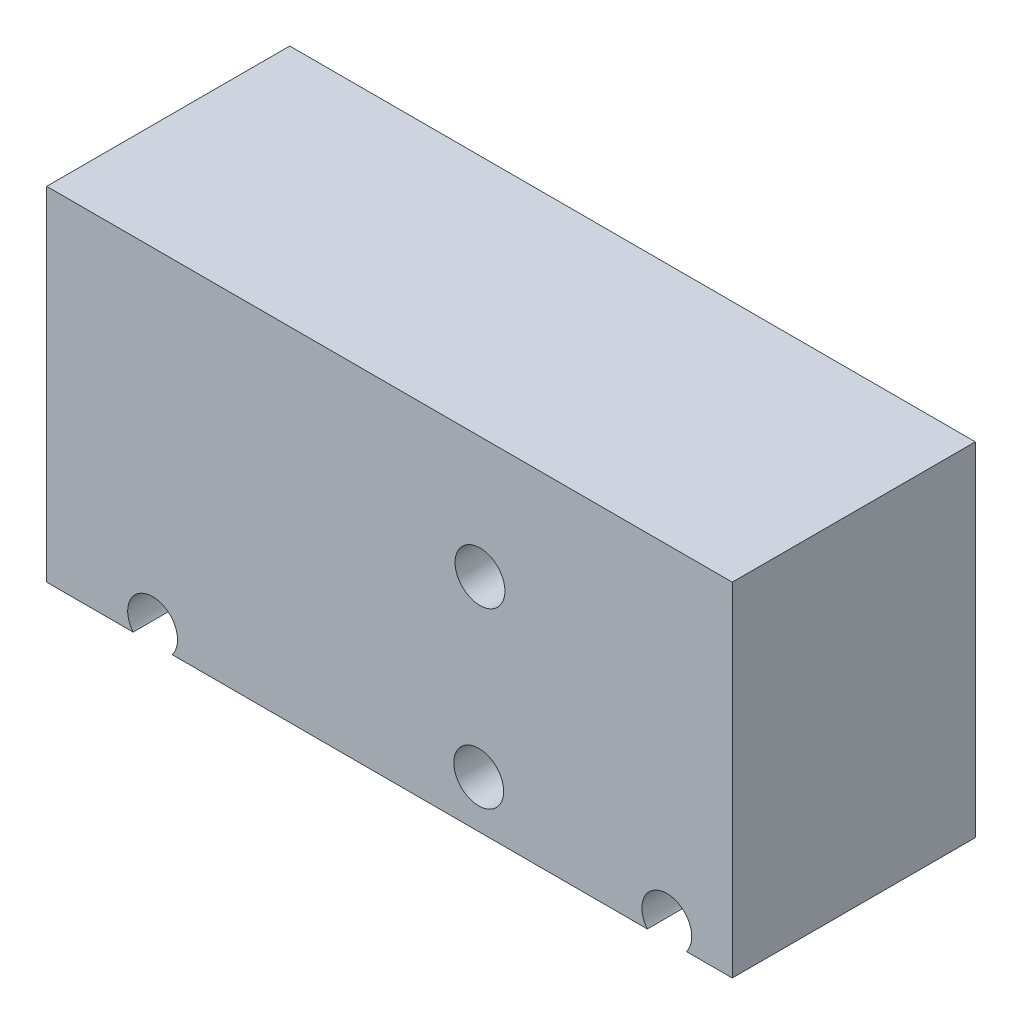
ISO-10303-21;
HEADER;
FILE_DESCRIPTION(('STEP AP214'),'2;1');
FILE_NAME('part.step','',(''),(''),'','','');
FILE_SCHEMA(('AUTOMOTIVE_DESIGN { 1 0 10303 214 1 1 1 1 }'));
ENDSEC;
DATA;
#1=APPLICATION_CONTEXT('core data for automotive mechanical design processes');
#2=APPLICATION_PROTOCOL_DEFINITION('international standard','automotive_design',2000,#1);
#3=PRODUCT_CONTEXT('',#1,'mechanical');
#4=PRODUCT('Part','Part','',(#3));
#5=PRODUCT_RELATED_PRODUCT_CATEGORY('part','',(#4));
#6=PRODUCT_DEFINITION_FORMATION('','',#4);
#7=PRODUCT_DEFINITION_CONTEXT('part definition',#1,'design');
#8=PRODUCT_DEFINITION('design','',#6,#7);
#9=PRODUCT_DEFINITION_SHAPE('','',#8);
#10=(LENGTH_UNIT() NAMED_UNIT(*) SI_UNIT(.MILLI.,.METRE.));
#11=(NAMED_UNIT(*) PLANE_ANGLE_UNIT() SI_UNIT($,.RADIAN.));
#12=(NAMED_UNIT(*) SI_UNIT($,.STERADIAN.) SOLID_ANGLE_UNIT());
#13=UNCERTAINTY_MEASURE_WITH_UNIT(LENGTH_MEASURE(1.E-05),#10,'distance_accuracy_value','');
#14=(GEOMETRIC_REPRESENTATION_CONTEXT(3) GLOBAL_UNCERTAINTY_ASSIGNED_CONTEXT((#13)) GLOBAL_UNIT_ASSIGNED_CONTEXT((#10,
#11,#12)) REPRESENTATION_CONTEXT('',''));
#15=CARTESIAN_POINT('',(0.,0.,0.));
#16=DIRECTION('',(0.,0.,1.));
#17=DIRECTION('',(1.,0.,0.));
#18=AXIS2_PLACEMENT_3D('',#15,#16,#17);
#19=CARTESIAN_POINT('',(14.524,8.01999999999999,39.));
#20=DIRECTION('',(0.,0.,-1.));
#21=DIRECTION('',(-1.,0.,0.));
#22=AXIS2_PLACEMENT_3D('',#19,#20,#21);
#23=CYLINDRICAL_SURFACE('',#22,4.);
#24=CARTESIAN_POINT('',(14.524,8.01999999999999,39.));
#25=DIRECTION('',(0.,0.,-1.));
#26=DIRECTION('',(-1.,0.,0.));
#27=AXIS2_PLACEMENT_3D('',#24,#25,#26);
#28=CIRCLE('',#27,4.);
#29=CARTESIAN_POINT('',(10.524,8.01999999999999,39.));
#30=VERTEX_POINT('',#29);
#31=EDGE_CURVE('E176',#30,#30,#28,.F.);
#32=ORIENTED_EDGE('',*,*,#31,.T.);
#33=EDGE_LOOP('',(#32));
#34=FACE_BOUND('',#33,.T.);
#35=CARTESIAN_POINT('',(14.524,8.01999999999999,3.));
#36=DIRECTION('',(0.,0.,-1.));
#37=DIRECTION('',(-1.,0.,0.));
#38=AXIS2_PLACEMENT_3D('',#35,#36,#37);
#39=CIRCLE('',#38,4.);
#40=CARTESIAN_POINT('',(10.524,8.01999999999999,3.));
#41=VERTEX_POINT('',#40);
#42=EDGE_CURVE('E20',#41,#41,#39,.T.);
#43=ORIENTED_EDGE('',*,*,#42,.T.);
#44=EDGE_LOOP('',(#43));
#45=FACE_BOUND('',#44,.T.);
#46=ADVANCED_FACE('F17',(#34,#45),#23,.F.);
#47=CARTESIAN_POINT('',(14.324,-19.92,39.));
#48=DIRECTION('',(0.,0.,-1.));
#49=DIRECTION('',(-1.,0.,0.));
#50=AXIS2_PLACEMENT_3D('',#47,#48,#49);
#51=CYLINDRICAL_SURFACE('',#50,4.);
#52=CARTESIAN_POINT('',(14.324,-19.92,39.));
#53=DIRECTION('',(0.,0.,-1.));
#54=DIRECTION('',(-1.,0.,0.));
#55=AXIS2_PLACEMENT_3D('',#52,#53,#54);
#56=CIRCLE('',#55,4.);
#57=CARTESIAN_POINT('',(10.324,-19.92,39.));
#58=VERTEX_POINT('',#57);
#59=EDGE_CURVE('E173',#58,#58,#56,.F.);
#60=ORIENTED_EDGE('',*,*,#59,.T.);
#61=EDGE_LOOP('',(#60));
#62=FACE_BOUND('',#61,.T.);
#63=CARTESIAN_POINT('',(14.324,-19.92,3.));
#64=DIRECTION('',(0.,0.,-1.));
#65=DIRECTION('',(-1.,0.,0.));
#66=AXIS2_PLACEMENT_3D('',#63,#64,#65);
#67=CIRCLE('',#66,4.);
#68=CARTESIAN_POINT('',(10.324,-19.92,3.));
#69=VERTEX_POINT('',#68);
#70=EDGE_CURVE('E90',#69,#69,#67,.T.);
#71=ORIENTED_EDGE('',*,*,#70,.T.);
#72=EDGE_LOOP('',(#71));
#73=FACE_BOUND('',#72,.T.);
#74=ADVANCED_FACE('F189',(#62,#73),#51,.F.);
#75=CARTESIAN_POINT('',(14.524,8.01999999999999,3.));
#76=DIRECTION('',(0.,0.,-1.));
#77=DIRECTION('',(-1.,0.,0.));
#78=AXIS2_PLACEMENT_3D('',#75,#76,#77);
#79=PLANE('',#78);
#80=CARTESIAN_POINT('',(14.524,8.01999999999999,3.));
#81=DIRECTION('',(0.,0.,-1.));
#82=DIRECTION('',(-1.,0.,0.));
#83=AXIS2_PLACEMENT_3D('',#80,#81,#82);
#84=CIRCLE('',#83,1.651);
#85=CARTESIAN_POINT('',(12.873,8.01999999999999,3.));
#86=VERTEX_POINT('',#85);
#87=EDGE_CURVE('E167',#86,#86,#84,.T.);
#88=ORIENTED_EDGE('',*,*,#87,.T.);
#89=EDGE_LOOP('',(#88));
#90=FACE_BOUND('',#89,.T.);
#91=ORIENTED_EDGE('',*,*,#42,.F.);
#92=EDGE_LOOP('',(#91));
#93=FACE_BOUND('',#92,.T.);
#94=ADVANCED_FACE('F186',(#90,#93),#79,.F.);
#95=CARTESIAN_POINT('',(14.324,-19.92,3.));
#96=DIRECTION('',(0.,0.,-1.));
#97=DIRECTION('',(-1.,0.,0.));
#98=AXIS2_PLACEMENT_3D('',#95,#96,#97);
#99=PLANE('',#98);
#100=CARTESIAN_POINT('',(14.324,-19.92,3.));
#101=DIRECTION('',(0.,0.,-1.));
#102=DIRECTION('',(-1.,0.,0.));
#103=AXIS2_PLACEMENT_3D('',#100,#101,#102);
#104=CIRCLE('',#103,1.651);
#105=CARTESIAN_POINT('',(12.673,-19.92,3.));
#106=VERTEX_POINT('',#105);
#107=EDGE_CURVE('E164',#106,#106,#104,.T.);
#108=ORIENTED_EDGE('',*,*,#107,.T.);
#109=EDGE_LOOP('',(#108));
#110=FACE_BOUND('',#109,.T.);
#111=ORIENTED_EDGE('',*,*,#70,.F.);
#112=EDGE_LOOP('',(#111));
#113=FACE_BOUND('',#112,.T.);
#114=ADVANCED_FACE('F188',(#110,#113),#99,.F.);
#115=CARTESIAN_POINT('',(-38.,-25.,3.));
#116=DIRECTION('',(0.,0.,-1.));
#117=DIRECTION('',(-1.,0.,0.));
#118=AXIS2_PLACEMENT_3D('',#115,#116,#117);
#119=PLANE('',#118);
#120=DIRECTION('',(1.,0.,0.));
#121=VECTOR('',#120,1.);
#122=CARTESIAN_POINT('',(-55.,-27.5,3.));
#123=LINE('',#122,#121);
#124=CARTESIAN_POINT('',(-41.1224989991992,-27.5,3.));
#125=VERTEX_POINT('',#124);
#126=CARTESIAN_POINT('',(-34.8775010008008,-27.5,3.));
#127=VERTEX_POINT('',#126);
#128=EDGE_CURVE('E80',#125,#127,#123,.T.);
#129=ORIENTED_EDGE('',*,*,#128,.T.);
#130=CARTESIAN_POINT('',(-38.,-25.,3.));
#131=DIRECTION('',(0.,0.,-1.));
#132=DIRECTION('',(-1.,0.,0.));
#133=AXIS2_PLACEMENT_3D('',#130,#131,#132);
#134=CIRCLE('',#133,4.);
#135=EDGE_CURVE('E82',#127,#125,#134,.F.);
#136=ORIENTED_EDGE('',*,*,#135,.T.);
#137=EDGE_LOOP('',(#129,#136));
#138=FACE_BOUND('',#137,.T.);
#139=CARTESIAN_POINT('',(-38.,-25.,3.));
#140=DIRECTION('',(0.,0.,-1.));
#141=DIRECTION('',(-1.,0.,0.));
#142=AXIS2_PLACEMENT_3D('',#139,#140,#141);
#143=CIRCLE('',#142,1.651);
#144=CARTESIAN_POINT('',(-39.651,-25.,3.));
#145=VERTEX_POINT('',#144);
#146=EDGE_CURVE('E126',#145,#145,#143,.T.);
#147=ORIENTED_EDGE('',*,*,#146,.T.);
#148=EDGE_LOOP('',(#147));
#149=FACE_BOUND('',#148,.T.);
#150=ADVANCED_FACE('F84',(#138,#149),#119,.F.);
#151=CARTESIAN_POINT('',(-38.,-25.,39.));
#152=DIRECTION('',(0.,0.,-1.));
#153=DIRECTION('',(-1.,0.,0.));
#154=AXIS2_PLACEMENT_3D('',#151,#152,#153);
#155=CYLINDRICAL_SURFACE('',#154,4.);
#156=DIRECTION('',(0.,0.,1.));
#157=VECTOR('',#156,1.);
#158=CARTESIAN_POINT('',(-34.8775010008008,-27.5,39.));
#159=LINE('',#158,#157);
#160=CARTESIAN_POINT('',(-34.8775010008008,-27.5,39.));
#161=VERTEX_POINT('',#160);
#162=EDGE_CURVE('E104',#127,#161,#159,.T.);
#163=ORIENTED_EDGE('',*,*,#162,.T.);
#164=CARTESIAN_POINT('',(-38.,-25.,39.));
#165=DIRECTION('',(0.,0.,-1.));
#166=DIRECTION('',(-1.,0.,0.));
#167=AXIS2_PLACEMENT_3D('',#164,#165,#166);
#168=CIRCLE('',#167,4.);
#169=CARTESIAN_POINT('',(-41.1224989991992,-27.5,39.));
#170=VERTEX_POINT('',#169);
#171=EDGE_CURVE('E95',#161,#170,#168,.F.);
#172=ORIENTED_EDGE('',*,*,#171,.T.);
#173=DIRECTION('',(0.,0.,1.));
#174=VECTOR('',#173,1.);
#175=CARTESIAN_POINT('',(-41.1224989991992,-27.5,39.));
#176=LINE('',#175,#174);
#177=EDGE_CURVE('E93',#170,#125,#176,.F.);
#178=ORIENTED_EDGE('',*,*,#177,.T.);
#179=ORIENTED_EDGE('',*,*,#135,.F.);
#180=EDGE_LOOP('',(#163,#172,#178,#179));
#181=FACE_BOUND('',#180,.T.);
#182=ADVANCED_FACE('F94',(#181),#155,.F.);
#183=CARTESIAN_POINT('',(44.5,-25.,3.));
#184=DIRECTION('',(0.,0.,-1.));
#185=DIRECTION('',(-1.,0.,0.));
#186=AXIS2_PLACEMENT_3D('',#183,#184,#185);
#187=PLANE('',#186);
#188=DIRECTION('',(1.,0.,0.));
#189=VECTOR('',#188,1.);
#190=CARTESIAN_POINT('',(-55.,-27.5,3.));
#191=LINE('',#190,#189);
#192=CARTESIAN_POINT('',(41.3775010008008,-27.5,3.));
#193=VERTEX_POINT('',#192);
#194=CARTESIAN_POINT('',(47.6224989991993,-27.5,3.));
#195=VERTEX_POINT('',#194);
#196=EDGE_CURVE('E370',#193,#195,#191,.T.);
#197=ORIENTED_EDGE('',*,*,#196,.T.);
#198=CARTESIAN_POINT('',(44.5,-25.,3.));
#199=DIRECTION('',(0.,0.,-1.));
#200=DIRECTION('',(-1.,0.,0.));
#201=AXIS2_PLACEMENT_3D('',#198,#199,#200);
#202=CIRCLE('',#201,4.);
#203=EDGE_CURVE('E89',#195,#193,#202,.F.);
#204=ORIENTED_EDGE('',*,*,#203,.T.);
#205=EDGE_LOOP('',(#197,#204));
#206=FACE_BOUND('',#205,.T.);
#207=CARTESIAN_POINT('',(44.5,-25.,3.));
#208=DIRECTION('',(0.,0.,-1.));
#209=DIRECTION('',(-1.,0.,0.));
#210=AXIS2_PLACEMENT_3D('',#207,#208,#209);
#211=CIRCLE('',#210,1.651);
#212=CARTESIAN_POINT('',(42.849,-25.,3.));
#213=VERTEX_POINT('',#212);
#214=EDGE_CURVE('E161',#213,#213,#211,.T.);
#215=ORIENTED_EDGE('',*,*,#214,.T.);
#216=EDGE_LOOP('',(#215));
#217=FACE_BOUND('',#216,.T.);
#218=ADVANCED_FACE('F245',(#206,#217),#187,.F.);
#219=CARTESIAN_POINT('',(44.5,-25.,39.));
#220=DIRECTION('',(0.,0.,-1.));
#221=DIRECTION('',(-1.,0.,0.));
#222=AXIS2_PLACEMENT_3D('',#219,#220,#221);
#223=CYLINDRICAL_SURFACE('',#222,4.);
#224=DIRECTION('',(0.,0.,1.));
#225=VECTOR('',#224,1.);
#226=CARTESIAN_POINT('',(47.6224989991993,-27.5,39.));
#227=LINE('',#226,#225);
#228=CARTESIAN_POINT('',(47.6224989991993,-27.5,39.));
#229=VERTEX_POINT('',#228);
#230=EDGE_CURVE('E376',#195,#229,#227,.T.);
#231=ORIENTED_EDGE('',*,*,#230,.T.);
#232=CARTESIAN_POINT('',(44.5,-25.,39.));
#233=DIRECTION('',(0.,0.,-1.));
#234=DIRECTION('',(-1.,0.,0.));
#235=AXIS2_PLACEMENT_3D('',#232,#233,#234);
#236=CIRCLE('',#235,4.);
#237=CARTESIAN_POINT('',(41.3775010008008,-27.5,39.));
#238=VERTEX_POINT('',#237);
#239=EDGE_CURVE('E170',#229,#238,#236,.F.);
#240=ORIENTED_EDGE('',*,*,#239,.T.);
#241=DIRECTION('',(0.,0.,1.));
#242=VECTOR('',#241,1.);
#243=CARTESIAN_POINT('',(41.3775010008008,-27.5,39.));
#244=LINE('',#243,#242);
#245=EDGE_CURVE('E377',#238,#193,#244,.F.);
#246=ORIENTED_EDGE('',*,*,#245,.T.);
#247=ORIENTED_EDGE('',*,*,#203,.F.);
#248=EDGE_LOOP('',(#231,#240,#246,#247));
#249=FACE_BOUND('',#248,.T.);
#250=ADVANCED_FACE('F241',(#249),#223,.F.);
#251=CARTESIAN_POINT('',(0.,0.,39.));
#252=DIRECTION('',(0.,0.,-1.));
#253=DIRECTION('',(-1.,0.,0.));
#254=AXIS2_PLACEMENT_3D('',#251,#252,#253);
#255=PLANE('',#254);
#256=ORIENTED_EDGE('',*,*,#239,.F.);
#257=DIRECTION('',(1.,0.,0.));
#258=VECTOR('',#257,1.);
#259=CARTESIAN_POINT('',(-55.,-27.5,39.));
#260=LINE('',#259,#258);
#261=CARTESIAN_POINT('',(55.,-27.5,39.));
#262=VERTEX_POINT('',#261);
#263=EDGE_CURVE('E117',#229,#262,#260,.T.);
#264=ORIENTED_EDGE('',*,*,#263,.T.);
#265=DIRECTION('',(0.,1.,0.));
#266=VECTOR('',#265,1.);
#267=CARTESIAN_POINT('',(55.,-27.5,39.));
#268=LINE('',#267,#266);
#269=CARTESIAN_POINT('',(55.,27.5,39.));
#270=VERTEX_POINT('',#269);
#271=EDGE_CURVE('E124',#262,#270,#268,.T.);
#272=ORIENTED_EDGE('',*,*,#271,.T.);
#273=DIRECTION('',(1.,0.,0.));
#274=VECTOR('',#273,1.);
#275=CARTESIAN_POINT('',(-55.,27.5,39.));
#276=LINE('',#275,#274);
#277=CARTESIAN_POINT('',(-55.,27.5,39.));
#278=VERTEX_POINT('',#277);
#279=EDGE_CURVE('E142',#270,#278,#276,.F.);
#280=ORIENTED_EDGE('',*,*,#279,.T.);
#281=DIRECTION('',(0.,1.,0.));
#282=VECTOR('',#281,1.);
#283=CARTESIAN_POINT('',(-55.,-27.5,39.));
#284=LINE('',#283,#282);
#285=CARTESIAN_POINT('',(-55.,-27.5,39.));
#286=VERTEX_POINT('',#285);
#287=EDGE_CURVE('E114',#278,#286,#284,.F.);
#288=ORIENTED_EDGE('',*,*,#287,.T.);
#289=DIRECTION('',(1.,0.,0.));
#290=VECTOR('',#289,1.);
#291=CARTESIAN_POINT('',(-55.,-27.5,39.));
#292=LINE('',#291,#290);
#293=EDGE_CURVE('E99',#286,#170,#292,.T.);
#294=ORIENTED_EDGE('',*,*,#293,.T.);
#295=ORIENTED_EDGE('',*,*,#171,.F.);
#296=DIRECTION('',(1.,0.,0.));
#297=VECTOR('',#296,1.);
#298=CARTESIAN_POINT('',(-55.,-27.5,39.));
#299=LINE('',#298,#297);
#300=EDGE_CURVE('E106',#161,#238,#299,.T.);
#301=ORIENTED_EDGE('',*,*,#300,.T.);
#302=EDGE_LOOP('',(#256,#264,#272,#280,#288,#294,#295,#301));
#303=FACE_BOUND('',#302,.T.);
#304=ORIENTED_EDGE('',*,*,#59,.F.);
#305=EDGE_LOOP('',(#304));
#306=FACE_BOUND('',#305,.T.);
#307=ORIENTED_EDGE('',*,*,#31,.F.);
#308=EDGE_LOOP('',(#307));
#309=FACE_BOUND('',#308,.T.);
#310=ADVANCED_FACE('F237',(#303,#306,#309),#255,.F.);
#311=CARTESIAN_POINT('',(14.524,8.01999999999999,39.));
#312=DIRECTION('',(0.,0.,-1.));
#313=DIRECTION('',(-1.,0.,0.));
#314=AXIS2_PLACEMENT_3D('',#311,#312,#313);
#315=CYLINDRICAL_SURFACE('',#314,1.651);
#316=CARTESIAN_POINT('',(14.524,8.01999999999999,0.));
#317=DIRECTION('',(0.,0.,-1.));
#318=DIRECTION('',(-1.,0.,0.));
#319=AXIS2_PLACEMENT_3D('',#316,#317,#318);
#320=CIRCLE('',#319,1.651);
#321=CARTESIAN_POINT('',(12.873,8.01999999999999,0.));
#322=VERTEX_POINT('',#321);
#323=EDGE_CURVE('E156',#322,#322,#320,.F.);
#324=ORIENTED_EDGE('',*,*,#323,.F.);
#325=EDGE_LOOP('',(#324));
#326=FACE_BOUND('',#325,.T.);
#327=ORIENTED_EDGE('',*,*,#87,.F.);
#328=EDGE_LOOP('',(#327));
#329=FACE_BOUND('',#328,.T.);
#330=ADVANCED_FACE('F233',(#326,#329),#315,.F.);
#331=CARTESIAN_POINT('',(14.324,-19.92,39.));
#332=DIRECTION('',(0.,0.,-1.));
#333=DIRECTION('',(-1.,0.,0.));
#334=AXIS2_PLACEMENT_3D('',#331,#332,#333);
#335=CYLINDRICAL_SURFACE('',#334,1.651);
#336=CARTESIAN_POINT('',(14.324,-19.92,0.));
#337=DIRECTION('',(0.,0.,-1.));
#338=DIRECTION('',(-1.,0.,0.));
#339=AXIS2_PLACEMENT_3D('',#336,#337,#338);
#340=CIRCLE('',#339,1.651);
#341=CARTESIAN_POINT('',(12.673,-19.92,0.));
#342=VERTEX_POINT('',#341);
#343=EDGE_CURVE('E153',#342,#342,#340,.F.);
#344=ORIENTED_EDGE('',*,*,#343,.F.);
#345=EDGE_LOOP('',(#344));
#346=FACE_BOUND('',#345,.T.);
#347=ORIENTED_EDGE('',*,*,#107,.F.);
#348=EDGE_LOOP('',(#347));
#349=FACE_BOUND('',#348,.T.);
#350=ADVANCED_FACE('F229',(#346,#349),#335,.F.);
#351=CARTESIAN_POINT('',(44.5,-25.,39.));
#352=DIRECTION('',(0.,0.,-1.));
#353=DIRECTION('',(-1.,0.,0.));
#354=AXIS2_PLACEMENT_3D('',#351,#352,#353);
#355=CYLINDRICAL_SURFACE('',#354,1.651);
#356=CARTESIAN_POINT('',(44.5,-25.,0.));
#357=DIRECTION('',(0.,0.,-1.));
#358=DIRECTION('',(-1.,0.,0.));
#359=AXIS2_PLACEMENT_3D('',#356,#357,#358);
#360=CIRCLE('',#359,1.651);
#361=CARTESIAN_POINT('',(42.849,-25.,0.));
#362=VERTEX_POINT('',#361);
#363=EDGE_CURVE('E150',#362,#362,#360,.F.);
#364=ORIENTED_EDGE('',*,*,#363,.F.);
#365=EDGE_LOOP('',(#364));
#366=FACE_BOUND('',#365,.T.);
#367=ORIENTED_EDGE('',*,*,#214,.F.);
#368=EDGE_LOOP('',(#367));
#369=FACE_BOUND('',#368,.T.);
#370=ADVANCED_FACE('F225',(#366,#369),#355,.F.);
#371=CARTESIAN_POINT('',(-38.,-25.,39.));
#372=DIRECTION('',(0.,0.,-1.));
#373=DIRECTION('',(-1.,0.,0.));
#374=AXIS2_PLACEMENT_3D('',#371,#372,#373);
#375=CYLINDRICAL_SURFACE('',#374,1.651);
#376=CARTESIAN_POINT('',(-38.,-25.,0.));
#377=DIRECTION('',(0.,0.,-1.));
#378=DIRECTION('',(-1.,0.,0.));
#379=AXIS2_PLACEMENT_3D('',#376,#377,#378);
#380=CIRCLE('',#379,1.651);
#381=CARTESIAN_POINT('',(-39.651,-25.,0.));
#382=VERTEX_POINT('',#381);
#383=EDGE_CURVE('E137',#382,#382,#380,.F.);
#384=ORIENTED_EDGE('',*,*,#383,.F.);
#385=EDGE_LOOP('',(#384));
#386=FACE_BOUND('',#385,.T.);
#387=ORIENTED_EDGE('',*,*,#146,.F.);
#388=EDGE_LOOP('',(#387));
#389=FACE_BOUND('',#388,.T.);
#390=ADVANCED_FACE('F221',(#386,#389),#375,.F.);
#391=CARTESIAN_POINT('',(55.,-27.5,39.));
#392=DIRECTION('',(-1.,0.,0.));
#393=DIRECTION('',(0.,0.,1.));
#394=AXIS2_PLACEMENT_3D('',#391,#392,#393);
#395=PLANE('',#394);
#396=DIRECTION('',(0.,0.,-1.));
#397=VECTOR('',#396,1.);
#398=CARTESIAN_POINT('',(55.,27.5,39.));
#399=LINE('',#398,#397);
#400=CARTESIAN_POINT('',(55.,27.5,0.));
#401=VERTEX_POINT('',#400);
#402=EDGE_CURVE('E121',#401,#270,#399,.F.);
#403=ORIENTED_EDGE('',*,*,#402,.T.);
#404=ORIENTED_EDGE('',*,*,#271,.F.);
#405=DIRECTION('',(0.,0.,1.));
#406=VECTOR('',#405,1.);
#407=CARTESIAN_POINT('',(55.,-27.5,39.));
#408=LINE('',#407,#406);
#409=CARTESIAN_POINT('',(55.,-27.5,0.));
#410=VERTEX_POINT('',#409);
#411=EDGE_CURVE('E111',#262,#410,#408,.F.);
#412=ORIENTED_EDGE('',*,*,#411,.T.);
#413=DIRECTION('',(0.,1.,0.));
#414=VECTOR('',#413,1.);
#415=CARTESIAN_POINT('',(55.,0.,0.));
#416=LINE('',#415,#414);
#417=EDGE_CURVE('E132',#401,#410,#416,.F.);
#418=ORIENTED_EDGE('',*,*,#417,.F.);
#419=EDGE_LOOP('',(#403,#404,#412,#418));
#420=FACE_BOUND('',#419,.T.);
#421=ADVANCED_FACE('F218',(#420),#395,.F.);
#422=CARTESIAN_POINT('',(-55.,-27.5,39.));
#423=DIRECTION('',(0.,1.,0.));
#424=DIRECTION('',(0.,0.,1.));
#425=AXIS2_PLACEMENT_3D('',#422,#423,#424);
#426=PLANE('',#425);
#427=ORIENTED_EDGE('',*,*,#230,.F.);
#428=ORIENTED_EDGE('',*,*,#196,.F.);
#429=ORIENTED_EDGE('',*,*,#245,.F.);
#430=ORIENTED_EDGE('',*,*,#300,.F.);
#431=ORIENTED_EDGE('',*,*,#162,.F.);
#432=ORIENTED_EDGE('',*,*,#128,.F.);
#433=ORIENTED_EDGE('',*,*,#177,.F.);
#434=ORIENTED_EDGE('',*,*,#293,.F.);
#435=DIRECTION('',(0.,0.,-1.));
#436=VECTOR('',#435,1.);
#437=CARTESIAN_POINT('',(-55.,-27.5,39.));
#438=LINE('',#437,#436);
#439=CARTESIAN_POINT('',(-55.,-27.5,0.));
#440=VERTEX_POINT('',#439);
#441=EDGE_CURVE('E116',#286,#440,#438,.T.);
#442=ORIENTED_EDGE('',*,*,#441,.T.);
#443=DIRECTION('',(-1.,0.,0.));
#444=VECTOR('',#443,1.);
#445=CARTESIAN_POINT('',(0.,-27.5,0.));
#446=LINE('',#445,#444);
#447=EDGE_CURVE('E129',#410,#440,#446,.T.);
#448=ORIENTED_EDGE('',*,*,#447,.F.);
#449=ORIENTED_EDGE('',*,*,#411,.F.);
#450=ORIENTED_EDGE('',*,*,#263,.F.);
#451=EDGE_LOOP('',(#427,#428,#429,#430,#431,#432,#433,#434,#442,#448,#449,#450));
#452=FACE_BOUND('',#451,.T.);
#453=ADVANCED_FACE('F102',(#452),#426,.F.);
#454=CARTESIAN_POINT('',(-55.,-27.5,39.));
#455=DIRECTION('',(1.,0.,0.));
#456=DIRECTION('',(0.,0.,-1.));
#457=AXIS2_PLACEMENT_3D('',#454,#455,#456);
#458=PLANE('',#457);
#459=ORIENTED_EDGE('',*,*,#441,.F.);
#460=ORIENTED_EDGE('',*,*,#287,.F.);
#461=DIRECTION('',(0.,0.,-1.));
#462=VECTOR('',#461,1.);
#463=CARTESIAN_POINT('',(-55.,27.5,39.));
#464=LINE('',#463,#462);
#465=CARTESIAN_POINT('',(-55.,27.5,0.));
#466=VERTEX_POINT('',#465);
#467=EDGE_CURVE('E35',#278,#466,#464,.T.);
#468=ORIENTED_EDGE('',*,*,#467,.T.);
#469=DIRECTION('',(0.,1.,0.));
#470=VECTOR('',#469,1.);
#471=CARTESIAN_POINT('',(-55.,0.,0.));
#472=LINE('',#471,#470);
#473=EDGE_CURVE('E26',#440,#466,#472,.T.);
#474=ORIENTED_EDGE('',*,*,#473,.F.);
#475=EDGE_LOOP('',(#459,#460,#468,#474));
#476=FACE_BOUND('',#475,.T.);
#477=ADVANCED_FACE('F208',(#476),#458,.F.);
#478=CARTESIAN_POINT('',(-55.,27.5,39.));
#479=DIRECTION('',(0.,-1.,0.));
#480=DIRECTION('',(0.,0.,-1.));
#481=AXIS2_PLACEMENT_3D('',#478,#479,#480);
#482=PLANE('',#481);
#483=ORIENTED_EDGE('',*,*,#467,.F.);
#484=ORIENTED_EDGE('',*,*,#279,.F.);
#485=ORIENTED_EDGE('',*,*,#402,.F.);
#486=DIRECTION('',(-1.,0.,0.));
#487=VECTOR('',#486,1.);
#488=CARTESIAN_POINT('',(0.,27.5,0.));
#489=LINE('',#488,#487);
#490=EDGE_CURVE('E11',#466,#401,#489,.F.);
#491=ORIENTED_EDGE('',*,*,#490,.F.);
#492=EDGE_LOOP('',(#483,#484,#485,#491));
#493=FACE_BOUND('',#492,.T.);
#494=ADVANCED_FACE('F202',(#493),#482,.F.);
#495=CARTESIAN_POINT('',(0.,0.,0.));
#496=DIRECTION('',(0.,0.,-1.));
#497=DIRECTION('',(-1.,0.,0.));
#498=AXIS2_PLACEMENT_3D('',#495,#496,#497);
#499=PLANE('',#498);
#500=ORIENTED_EDGE('',*,*,#473,.T.);
#501=ORIENTED_EDGE('',*,*,#490,.T.);
#502=ORIENTED_EDGE('',*,*,#417,.T.);
#503=ORIENTED_EDGE('',*,*,#447,.T.);
#504=EDGE_LOOP('',(#500,#501,#502,#503));
#505=FACE_BOUND('',#504,.T.);
#506=ORIENTED_EDGE('',*,*,#383,.T.);
#507=EDGE_LOOP('',(#506));
#508=FACE_BOUND('',#507,.T.);
#509=ORIENTED_EDGE('',*,*,#363,.T.);
#510=EDGE_LOOP('',(#509));
#511=FACE_BOUND('',#510,.T.);
#512=ORIENTED_EDGE('',*,*,#343,.T.);
#513=EDGE_LOOP('',(#512));
#514=FACE_BOUND('',#513,.T.);
#515=ORIENTED_EDGE('',*,*,#323,.T.);
#516=EDGE_LOOP('',(#515));
#517=FACE_BOUND('',#516,.T.);
#518=ADVANCED_FACE('F200',(#505,#508,#511,#514,#517),#499,.T.);
#519=CLOSED_SHELL('',(#46,#74,#94,#114,#150,#182,#218,#250,#310,#330,#350,#370,#390,#421,#453,
#477,#494,#518));
#520=MANIFOLD_SOLID_BREP('B1',#519);
#521=ADVANCED_BREP_SHAPE_REPRESENTATION('',(#18,#520),#14);
#522=SHAPE_DEFINITION_REPRESENTATION(#9,#521);
ENDSEC;
END-ISO-10303-21;
